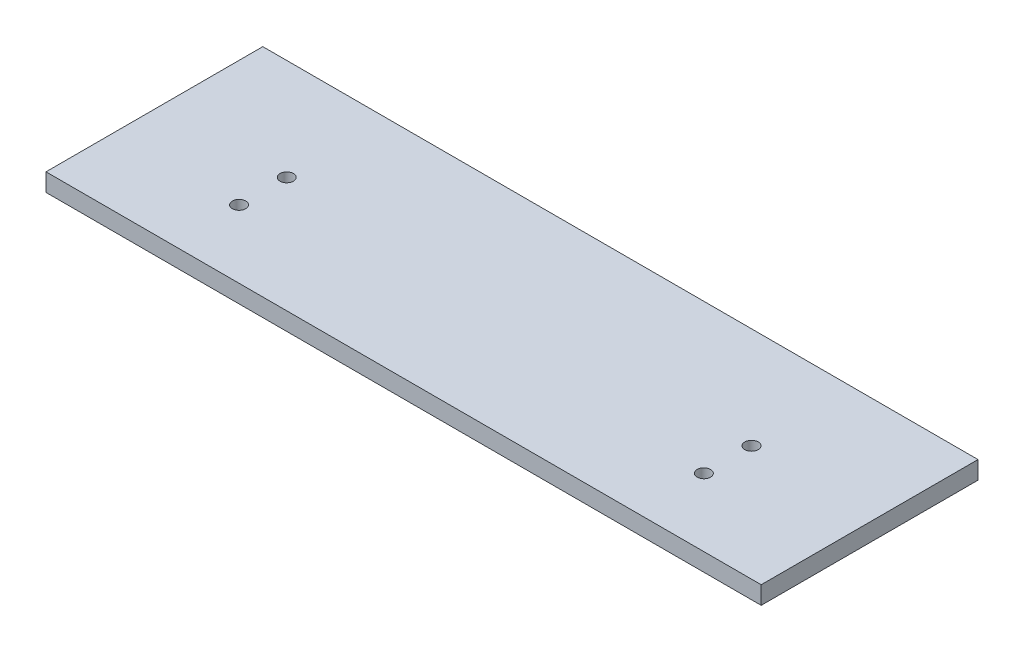
ISO-10303-21;
HEADER;
FILE_DESCRIPTION(('STEP AP214'),'2;1');
FILE_NAME('part.step','',(''),(''),'','','');
FILE_SCHEMA(('AUTOMOTIVE_DESIGN { 1 0 10303 214 1 1 1 1 }'));
ENDSEC;
DATA;
#1=APPLICATION_CONTEXT('core data for automotive mechanical design processes');
#2=APPLICATION_PROTOCOL_DEFINITION('international standard','automotive_design',2000,#1);
#3=PRODUCT_CONTEXT('',#1,'mechanical');
#4=PRODUCT('Part','Part','',(#3));
#5=PRODUCT_RELATED_PRODUCT_CATEGORY('part','',(#4));
#6=PRODUCT_DEFINITION_FORMATION('','',#4);
#7=PRODUCT_DEFINITION_CONTEXT('part definition',#1,'design');
#8=PRODUCT_DEFINITION('design','',#6,#7);
#9=PRODUCT_DEFINITION_SHAPE('','',#8);
#10=(LENGTH_UNIT() NAMED_UNIT(*) SI_UNIT(.MILLI.,.METRE.));
#11=(NAMED_UNIT(*) PLANE_ANGLE_UNIT() SI_UNIT($,.RADIAN.));
#12=(NAMED_UNIT(*) SI_UNIT($,.STERADIAN.) SOLID_ANGLE_UNIT());
#13=UNCERTAINTY_MEASURE_WITH_UNIT(LENGTH_MEASURE(1.E-05),#10,'distance_accuracy_value','');
#14=(GEOMETRIC_REPRESENTATION_CONTEXT(3) GLOBAL_UNCERTAINTY_ASSIGNED_CONTEXT((#13)) GLOBAL_UNIT_ASSIGNED_CONTEXT((#10,
#11,#12)) REPRESENTATION_CONTEXT('',''));
#15=CARTESIAN_POINT('',(0.,0.,0.));
#16=DIRECTION('',(0.,0.,1.));
#17=DIRECTION('',(1.,0.,0.));
#18=AXIS2_PLACEMENT_3D('',#15,#16,#17);
#19=CARTESIAN_POINT('',(0.,12.7,0.));
#20=DIRECTION('',(0.,1.,0.));
#21=DIRECTION('',(0.,0.,1.));
#22=AXIS2_PLACEMENT_3D('',#19,#20,#21);
#23=PLANE('',#22);
#24=CARTESIAN_POINT('',(225.801639180127,12.7,-105.876563154009));
#25=DIRECTION('',(0.,1.,0.));
#26=DIRECTION('',(0.,0.,1.));
#27=AXIS2_PLACEMENT_3D('',#24,#25,#26);
#28=CIRCLE('',#27,4.76250000000001);
#29=CARTESIAN_POINT('',(225.801639180127,12.7,-101.114063154009));
#30=VERTEX_POINT('',#29);
#31=EDGE_CURVE('E130',#30,#30,#28,.T.);
#32=ORIENTED_EDGE('',*,*,#31,.F.);
#33=EDGE_LOOP('',(#32));
#34=FACE_BOUND('',#33,.T.);
#35=CARTESIAN_POINT('',(-104.398360819873,12.7,-105.927631204414));
#36=DIRECTION('',(0.,1.,0.));
#37=DIRECTION('',(0.,0.,1.));
#38=AXIS2_PLACEMENT_3D('',#35,#36,#37);
#39=CIRCLE('',#38,4.7625);
#40=CARTESIAN_POINT('',(-104.398360819873,12.7,-101.165131204414));
#41=VERTEX_POINT('',#40);
#42=EDGE_CURVE('E109',#41,#41,#39,.T.);
#43=ORIENTED_EDGE('',*,*,#42,.F.);
#44=EDGE_LOOP('',(#43));
#45=FACE_BOUND('',#44,.T.);
#46=DIRECTION('',(0.,0.,1.));
#47=VECTOR('',#46,1.);
#48=CARTESIAN_POINT('',(-193.298360819873,12.7,-177.843229820679));
#49=LINE('',#48,#47);
#50=CARTESIAN_POINT('',(-193.298360819873,12.7,-177.843229820679));
#51=VERTEX_POINT('',#50);
#52=CARTESIAN_POINT('',(-193.298360819873,12.7,-23.8432838206791));
#53=VERTEX_POINT('',#52);
#54=EDGE_CURVE('E94',#51,#53,#49,.T.);
#55=ORIENTED_EDGE('',*,*,#54,.T.);
#56=DIRECTION('',(1.,0.,0.));
#57=VECTOR('',#56,1.);
#58=CARTESIAN_POINT('',(-193.298360819873,12.7,-23.8432838206791));
#59=LINE('',#58,#57);
#60=CARTESIAN_POINT('',(314.701639180127,12.7,-23.8432838206791));
#61=VERTEX_POINT('',#60);
#62=EDGE_CURVE('E89',#53,#61,#59,.T.);
#63=ORIENTED_EDGE('',*,*,#62,.T.);
#64=DIRECTION('',(0.,0.,-1.));
#65=VECTOR('',#64,1.);
#66=CARTESIAN_POINT('',(314.701639180127,12.7,-177.843229820679));
#67=LINE('',#66,#65);
#68=CARTESIAN_POINT('',(314.701639180127,12.7,-177.843229820679));
#69=VERTEX_POINT('',#68);
#70=EDGE_CURVE('E92',#61,#69,#67,.T.);
#71=ORIENTED_EDGE('',*,*,#70,.T.);
#72=DIRECTION('',(-1.,0.,0.));
#73=VECTOR('',#72,1.);
#74=CARTESIAN_POINT('',(-193.298360819873,12.7,-177.843229820679));
#75=LINE('',#74,#73);
#76=EDGE_CURVE('E59',#69,#51,#75,.T.);
#77=ORIENTED_EDGE('',*,*,#76,.T.);
#78=EDGE_LOOP('',(#55,#63,#71,#77));
#79=FACE_BOUND('',#78,.T.);
#80=CARTESIAN_POINT('',(-104.398360819873,12.7,-72.0906734090334));
#81=DIRECTION('',(0.,1.,0.));
#82=DIRECTION('',(0.,0.,1.));
#83=AXIS2_PLACEMENT_3D('',#80,#81,#82);
#84=CIRCLE('',#83,4.7625);
#85=CARTESIAN_POINT('',(-104.398360819873,12.7,-67.3281734090334));
#86=VERTEX_POINT('',#85);
#87=EDGE_CURVE('E124',#86,#86,#84,.T.);
#88=ORIENTED_EDGE('',*,*,#87,.F.);
#89=EDGE_LOOP('',(#88));
#90=FACE_BOUND('',#89,.T.);
#91=CARTESIAN_POINT('',(225.801639180127,12.7,-72.0098964873467));
#92=DIRECTION('',(0.,1.,0.));
#93=DIRECTION('',(0.,0.,1.));
#94=AXIS2_PLACEMENT_3D('',#91,#92,#93);
#95=CIRCLE('',#94,4.76250000000001);
#96=CARTESIAN_POINT('',(225.801639180127,12.7,-67.2473964873467));
#97=VERTEX_POINT('',#96);
#98=EDGE_CURVE('E136',#97,#97,#95,.T.);
#99=ORIENTED_EDGE('',*,*,#98,.F.);
#100=EDGE_LOOP('',(#99));
#101=FACE_BOUND('',#100,.T.);
#102=ADVANCED_FACE('F42',(#34,#45,#79,#90,#101),#23,.T.);
#103=CARTESIAN_POINT('',(0.,0.,0.));
#104=DIRECTION('',(0.,1.,0.));
#105=DIRECTION('',(0.,0.,1.));
#106=AXIS2_PLACEMENT_3D('',#103,#104,#105);
#107=PLANE('',#106);
#108=DIRECTION('',(0.,0.,1.));
#109=VECTOR('',#108,1.);
#110=CARTESIAN_POINT('',(-193.298360819873,0.,-177.843229820679));
#111=LINE('',#110,#109);
#112=CARTESIAN_POINT('',(-193.298360819873,0.,-177.843229820679));
#113=VERTEX_POINT('',#112);
#114=CARTESIAN_POINT('',(-193.298360819873,0.,-23.8432838206791));
#115=VERTEX_POINT('',#114);
#116=EDGE_CURVE('E106',#113,#115,#111,.T.);
#117=ORIENTED_EDGE('',*,*,#116,.F.);
#118=DIRECTION('',(-1.,0.,0.));
#119=VECTOR('',#118,1.);
#120=CARTESIAN_POINT('',(-193.298360819873,0.,-177.843229820679));
#121=LINE('',#120,#119);
#122=CARTESIAN_POINT('',(314.701639180127,0.,-177.843229820679));
#123=VERTEX_POINT('',#122);
#124=EDGE_CURVE('E82',#123,#113,#121,.T.);
#125=ORIENTED_EDGE('',*,*,#124,.F.);
#126=DIRECTION('',(0.,0.,-1.));
#127=VECTOR('',#126,1.);
#128=CARTESIAN_POINT('',(314.701639180127,0.,-177.843229820679));
#129=LINE('',#128,#127);
#130=CARTESIAN_POINT('',(314.701639180127,0.,-23.8432838206791));
#131=VERTEX_POINT('',#130);
#132=EDGE_CURVE('E76',#131,#123,#129,.T.);
#133=ORIENTED_EDGE('',*,*,#132,.F.);
#134=DIRECTION('',(1.,0.,0.));
#135=VECTOR('',#134,1.);
#136=CARTESIAN_POINT('',(-193.298360819873,0.,-23.8432838206791));
#137=LINE('',#136,#135);
#138=EDGE_CURVE('E98',#115,#131,#137,.T.);
#139=ORIENTED_EDGE('',*,*,#138,.F.);
#140=EDGE_LOOP('',(#117,#125,#133,#139));
#141=FACE_BOUND('',#140,.T.);
#142=CARTESIAN_POINT('',(-104.398360819873,0.,-105.927631204414));
#143=DIRECTION('',(0.,1.,0.));
#144=DIRECTION('',(0.,0.,1.));
#145=AXIS2_PLACEMENT_3D('',#142,#143,#144);
#146=CIRCLE('',#145,4.7625);
#147=CARTESIAN_POINT('',(-104.398360819873,0.,-101.165131204414));
#148=VERTEX_POINT('',#147);
#149=EDGE_CURVE('E121',#148,#148,#146,.T.);
#150=ORIENTED_EDGE('',*,*,#149,.T.);
#151=EDGE_LOOP('',(#150));
#152=FACE_BOUND('',#151,.T.);
#153=CARTESIAN_POINT('',(-104.398360819873,0.,-72.0906734090334));
#154=DIRECTION('',(0.,1.,0.));
#155=DIRECTION('',(0.,0.,1.));
#156=AXIS2_PLACEMENT_3D('',#153,#154,#155);
#157=CIRCLE('',#156,4.7625);
#158=CARTESIAN_POINT('',(-104.398360819873,0.,-67.3281734090334));
#159=VERTEX_POINT('',#158);
#160=EDGE_CURVE('E127',#159,#159,#157,.T.);
#161=ORIENTED_EDGE('',*,*,#160,.T.);
#162=EDGE_LOOP('',(#161));
#163=FACE_BOUND('',#162,.T.);
#164=CARTESIAN_POINT('',(225.801639180127,0.,-105.876563154009));
#165=DIRECTION('',(0.,1.,0.));
#166=DIRECTION('',(0.,0.,1.));
#167=AXIS2_PLACEMENT_3D('',#164,#165,#166);
#168=CIRCLE('',#167,4.76250000000001);
#169=CARTESIAN_POINT('',(225.801639180127,0.,-101.114063154009));
#170=VERTEX_POINT('',#169);
#171=EDGE_CURVE('E133',#170,#170,#168,.T.);
#172=ORIENTED_EDGE('',*,*,#171,.T.);
#173=EDGE_LOOP('',(#172));
#174=FACE_BOUND('',#173,.T.);
#175=CARTESIAN_POINT('',(225.801639180127,0.,-72.0098964873467));
#176=DIRECTION('',(0.,1.,0.));
#177=DIRECTION('',(0.,0.,1.));
#178=AXIS2_PLACEMENT_3D('',#175,#176,#177);
#179=CIRCLE('',#178,4.76250000000001);
#180=CARTESIAN_POINT('',(225.801639180127,0.,-67.2473964873467));
#181=VERTEX_POINT('',#180);
#182=EDGE_CURVE('E139',#181,#181,#179,.T.);
#183=ORIENTED_EDGE('',*,*,#182,.T.);
#184=EDGE_LOOP('',(#183));
#185=FACE_BOUND('',#184,.T.);
#186=ADVANCED_FACE('F117',(#141,#152,#163,#174,#185),#107,.F.);
#187=CARTESIAN_POINT('',(-193.298360819873,12.7,-177.843229820679));
#188=DIRECTION('',(1.,0.,0.));
#189=DIRECTION('',(0.,0.,-1.));
#190=AXIS2_PLACEMENT_3D('',#187,#188,#189);
#191=PLANE('',#190);
#192=ORIENTED_EDGE('',*,*,#116,.T.);
#193=DIRECTION('',(0.,-1.,0.));
#194=VECTOR('',#193,1.);
#195=CARTESIAN_POINT('',(-193.298360819873,12.7,-23.8432838206791));
#196=LINE('',#195,#194);
#197=EDGE_CURVE('E11',#53,#115,#196,.T.);
#198=ORIENTED_EDGE('',*,*,#197,.F.);
#199=ORIENTED_EDGE('',*,*,#54,.F.);
#200=DIRECTION('',(0.,-1.,0.));
#201=VECTOR('',#200,1.);
#202=CARTESIAN_POINT('',(-193.298360819873,12.7,-177.843229820679));
#203=LINE('',#202,#201);
#204=EDGE_CURVE('E102',#51,#113,#203,.T.);
#205=ORIENTED_EDGE('',*,*,#204,.T.);
#206=EDGE_LOOP('',(#192,#198,#199,#205));
#207=FACE_BOUND('',#206,.T.);
#208=ADVANCED_FACE('F44',(#207),#191,.F.);
#209=CARTESIAN_POINT('',(-193.298360819873,12.7,-23.8432838206791));
#210=DIRECTION('',(0.,0.,-1.));
#211=DIRECTION('',(-1.,0.,0.));
#212=AXIS2_PLACEMENT_3D('',#209,#210,#211);
#213=PLANE('',#212);
#214=ORIENTED_EDGE('',*,*,#138,.T.);
#215=DIRECTION('',(0.,-1.,0.));
#216=VECTOR('',#215,1.);
#217=CARTESIAN_POINT('',(314.701639180127,12.7,-23.8432838206791));
#218=LINE('',#217,#216);
#219=EDGE_CURVE('E51',#61,#131,#218,.T.);
#220=ORIENTED_EDGE('',*,*,#219,.F.);
#221=ORIENTED_EDGE('',*,*,#62,.F.);
#222=ORIENTED_EDGE('',*,*,#197,.T.);
#223=EDGE_LOOP('',(#214,#220,#221,#222));
#224=FACE_BOUND('',#223,.T.);
#225=ADVANCED_FACE('F97',(#224),#213,.F.);
#226=CARTESIAN_POINT('',(314.701639180127,12.7,-177.843229820679));
#227=DIRECTION('',(-1.,0.,0.));
#228=DIRECTION('',(0.,0.,1.));
#229=AXIS2_PLACEMENT_3D('',#226,#227,#228);
#230=PLANE('',#229);
#231=ORIENTED_EDGE('',*,*,#132,.T.);
#232=DIRECTION('',(0.,-1.,0.));
#233=VECTOR('',#232,1.);
#234=CARTESIAN_POINT('',(314.701639180127,12.7,-177.843229820679));
#235=LINE('',#234,#233);
#236=EDGE_CURVE('E99',#69,#123,#235,.T.);
#237=ORIENTED_EDGE('',*,*,#236,.F.);
#238=ORIENTED_EDGE('',*,*,#70,.F.);
#239=ORIENTED_EDGE('',*,*,#219,.T.);
#240=EDGE_LOOP('',(#231,#237,#238,#239));
#241=FACE_BOUND('',#240,.T.);
#242=ADVANCED_FACE('F100',(#241),#230,.F.);
#243=CARTESIAN_POINT('',(-193.298360819873,12.7,-177.843229820679));
#244=DIRECTION('',(0.,0.,1.));
#245=DIRECTION('',(1.,0.,0.));
#246=AXIS2_PLACEMENT_3D('',#243,#244,#245);
#247=PLANE('',#246);
#248=ORIENTED_EDGE('',*,*,#124,.T.);
#249=ORIENTED_EDGE('',*,*,#204,.F.);
#250=ORIENTED_EDGE('',*,*,#76,.F.);
#251=ORIENTED_EDGE('',*,*,#236,.T.);
#252=EDGE_LOOP('',(#248,#249,#250,#251));
#253=FACE_BOUND('',#252,.T.);
#254=ADVANCED_FACE('F114',(#253),#247,.F.);
#255=CARTESIAN_POINT('',(-104.398360819873,12.7,-105.927631204414));
#256=DIRECTION('',(0.,-1.,0.));
#257=DIRECTION('',(0.,0.,-1.));
#258=AXIS2_PLACEMENT_3D('',#255,#256,#257);
#259=CYLINDRICAL_SURFACE('',#258,4.7625);
#260=ORIENTED_EDGE('',*,*,#42,.T.);
#261=EDGE_LOOP('',(#260));
#262=FACE_BOUND('',#261,.T.);
#263=ORIENTED_EDGE('',*,*,#149,.F.);
#264=EDGE_LOOP('',(#263));
#265=FACE_BOUND('',#264,.T.);
#266=ADVANCED_FACE('F158',(#262,#265),#259,.F.);
#267=CARTESIAN_POINT('',(-104.398360819873,12.7,-72.0906734090334));
#268=DIRECTION('',(0.,-1.,0.));
#269=DIRECTION('',(0.,0.,-1.));
#270=AXIS2_PLACEMENT_3D('',#267,#268,#269);
#271=CYLINDRICAL_SURFACE('',#270,4.7625);
#272=ORIENTED_EDGE('',*,*,#87,.T.);
#273=EDGE_LOOP('',(#272));
#274=FACE_BOUND('',#273,.T.);
#275=ORIENTED_EDGE('',*,*,#160,.F.);
#276=EDGE_LOOP('',(#275));
#277=FACE_BOUND('',#276,.T.);
#278=ADVANCED_FACE('F203',(#274,#277),#271,.F.);
#279=CARTESIAN_POINT('',(225.801639180127,12.7,-105.876563154009));
#280=DIRECTION('',(0.,-1.,0.));
#281=DIRECTION('',(0.,0.,-1.));
#282=AXIS2_PLACEMENT_3D('',#279,#280,#281);
#283=CYLINDRICAL_SURFACE('',#282,4.76250000000001);
#284=ORIENTED_EDGE('',*,*,#31,.T.);
#285=EDGE_LOOP('',(#284));
#286=FACE_BOUND('',#285,.T.);
#287=ORIENTED_EDGE('',*,*,#171,.F.);
#288=EDGE_LOOP('',(#287));
#289=FACE_BOUND('',#288,.T.);
#290=ADVANCED_FACE('F211',(#286,#289),#283,.F.);
#291=CARTESIAN_POINT('',(225.801639180127,12.7,-72.0098964873467));
#292=DIRECTION('',(0.,-1.,0.));
#293=DIRECTION('',(0.,0.,-1.));
#294=AXIS2_PLACEMENT_3D('',#291,#292,#293);
#295=CYLINDRICAL_SURFACE('',#294,4.76250000000001);
#296=ORIENTED_EDGE('',*,*,#98,.T.);
#297=EDGE_LOOP('',(#296));
#298=FACE_BOUND('',#297,.T.);
#299=ORIENTED_EDGE('',*,*,#182,.F.);
#300=EDGE_LOOP('',(#299));
#301=FACE_BOUND('',#300,.T.);
#302=ADVANCED_FACE('F145',(#298,#301),#295,.F.);
#303=CLOSED_SHELL('',(#102,#186,#208,#225,#242,#254,#266,#278,#290,#302));
#304=MANIFOLD_SOLID_BREP('B2',#303);
#305=ADVANCED_BREP_SHAPE_REPRESENTATION('',(#18,#304),#14);
#306=SHAPE_DEFINITION_REPRESENTATION(#9,#305);
ENDSEC;
END-ISO-10303-21;
